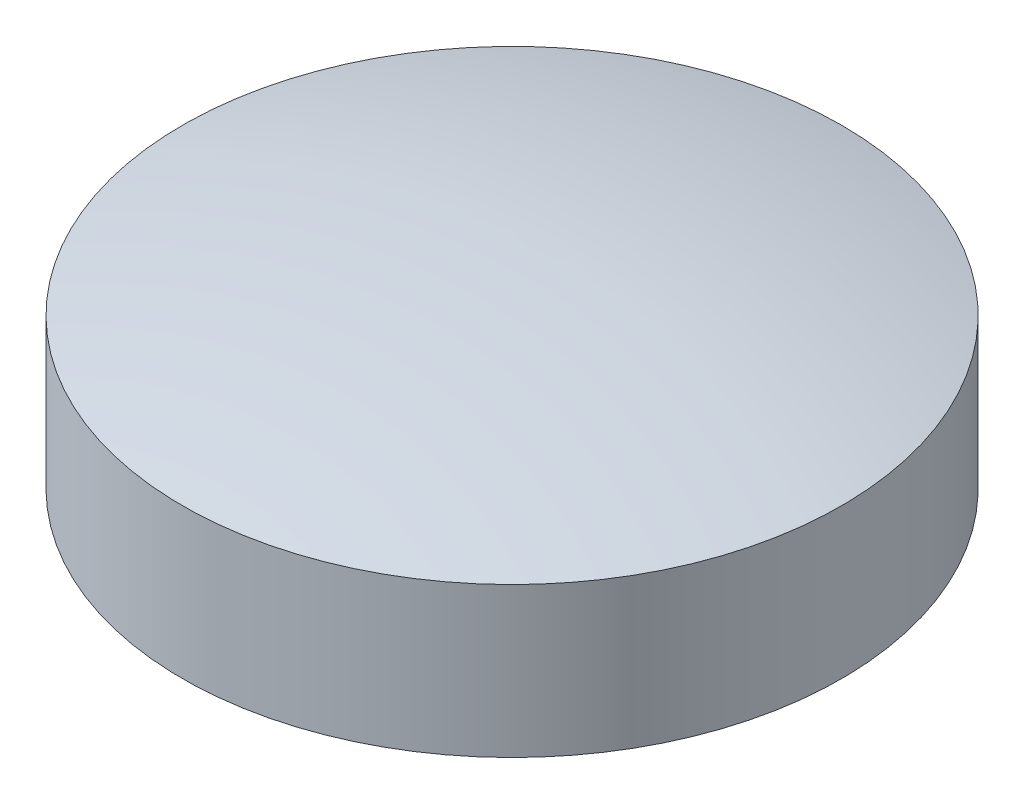
ISO-10303-21;
HEADER;
FILE_DESCRIPTION(('STEP AP214'),'2;1');
FILE_NAME('part.step','',(''),(''),'','','');
FILE_SCHEMA(('AUTOMOTIVE_DESIGN { 1 0 10303 214 1 1 1 1 }'));
ENDSEC;
DATA;
#1=APPLICATION_CONTEXT('core data for automotive mechanical design processes');
#2=APPLICATION_PROTOCOL_DEFINITION('international standard','automotive_design',2000,#1);
#3=PRODUCT_CONTEXT('',#1,'mechanical');
#4=PRODUCT('Part','Part','',(#3));
#5=PRODUCT_RELATED_PRODUCT_CATEGORY('part','',(#4));
#6=PRODUCT_DEFINITION_FORMATION('','',#4);
#7=PRODUCT_DEFINITION_CONTEXT('part definition',#1,'design');
#8=PRODUCT_DEFINITION('design','',#6,#7);
#9=PRODUCT_DEFINITION_SHAPE('','',#8);
#10=(LENGTH_UNIT() NAMED_UNIT(*) SI_UNIT(.MILLI.,.METRE.));
#11=(NAMED_UNIT(*) PLANE_ANGLE_UNIT() SI_UNIT($,.RADIAN.));
#12=(NAMED_UNIT(*) SI_UNIT($,.STERADIAN.) SOLID_ANGLE_UNIT());
#13=UNCERTAINTY_MEASURE_WITH_UNIT(LENGTH_MEASURE(1.E-05),#10,'distance_accuracy_value','');
#14=(GEOMETRIC_REPRESENTATION_CONTEXT(3) GLOBAL_UNCERTAINTY_ASSIGNED_CONTEXT((#13)) GLOBAL_UNIT_ASSIGNED_CONTEXT((#10,
#11,#12)) REPRESENTATION_CONTEXT('',''));
#15=CARTESIAN_POINT('',(0.,0.,0.));
#16=DIRECTION('',(0.,0.,1.));
#17=DIRECTION('',(1.,0.,0.));
#18=AXIS2_PLACEMENT_3D('',#15,#16,#17);
#19=CARTESIAN_POINT('',(0.,-69.1666666666664,0.));
#20=DIRECTION('',(0.,-1.,0.));
#21=DIRECTION('',(0.,0.,-1.));
#22=AXIS2_PLACEMENT_3D('',#19,#20,#21);
#23=SPHERICAL_SURFACE('',#22,82.1666666666664);
#24=CARTESIAN_POINT('',(0.,10.,0.));
#25=DIRECTION('',(0.,-1.,0.));
#26=DIRECTION('',(0.,0.,-1.));
#27=AXIS2_PLACEMENT_3D('',#24,#25,#26);
#28=CIRCLE('',#27,22.);
#29=CARTESIAN_POINT('',(0.,10.,-22.));
#30=VERTEX_POINT('',#29);
#31=EDGE_CURVE('E10',#30,#30,#28,.T.);
#32=ORIENTED_EDGE('',*,*,#31,.F.);
#33=EDGE_LOOP('',(#32));
#34=FACE_BOUND('',#33,.T.);
#35=ADVANCED_FACE('F31',(#34),#23,.T.);
#36=CARTESIAN_POINT('',(0.,0.,0.));
#37=DIRECTION('',(0.,-1.,0.));
#38=DIRECTION('',(0.,0.,-1.));
#39=AXIS2_PLACEMENT_3D('',#36,#37,#38);
#40=CYLINDRICAL_SURFACE('',#39,22.);
#41=ORIENTED_EDGE('',*,*,#31,.T.);
#42=EDGE_LOOP('',(#41));
#43=FACE_BOUND('',#42,.T.);
#44=CARTESIAN_POINT('',(0.,0.,0.));
#45=DIRECTION('',(0.,-1.,0.));
#46=DIRECTION('',(0.,0.,-1.));
#47=AXIS2_PLACEMENT_3D('',#44,#45,#46);
#48=CIRCLE('',#47,22.);
#49=CARTESIAN_POINT('',(0.,0.,-22.));
#50=VERTEX_POINT('',#49);
#51=EDGE_CURVE('E37',#50,#50,#48,.T.);
#52=ORIENTED_EDGE('',*,*,#51,.F.);
#53=EDGE_LOOP('',(#52));
#54=FACE_BOUND('',#53,.T.);
#55=ADVANCED_FACE('F45',(#43,#54),#40,.T.);
#56=CARTESIAN_POINT('',(0.,0.,0.));
#57=DIRECTION('',(0.,-1.,0.));
#58=DIRECTION('',(0.,0.,-1.));
#59=AXIS2_PLACEMENT_3D('',#56,#57,#58);
#60=PLANE('',#59);
#61=ORIENTED_EDGE('',*,*,#51,.T.);
#62=EDGE_LOOP('',(#61));
#63=FACE_BOUND('',#62,.T.);
#64=ADVANCED_FACE('F43',(#63),#60,.T.);
#65=CLOSED_SHELL('',(#35,#55,#64));
#66=MANIFOLD_SOLID_BREP('B2',#65);
#67=ADVANCED_BREP_SHAPE_REPRESENTATION('',(#18,#66),#14);
#68=SHAPE_DEFINITION_REPRESENTATION(#9,#67);
ENDSEC;
END-ISO-10303-21;
